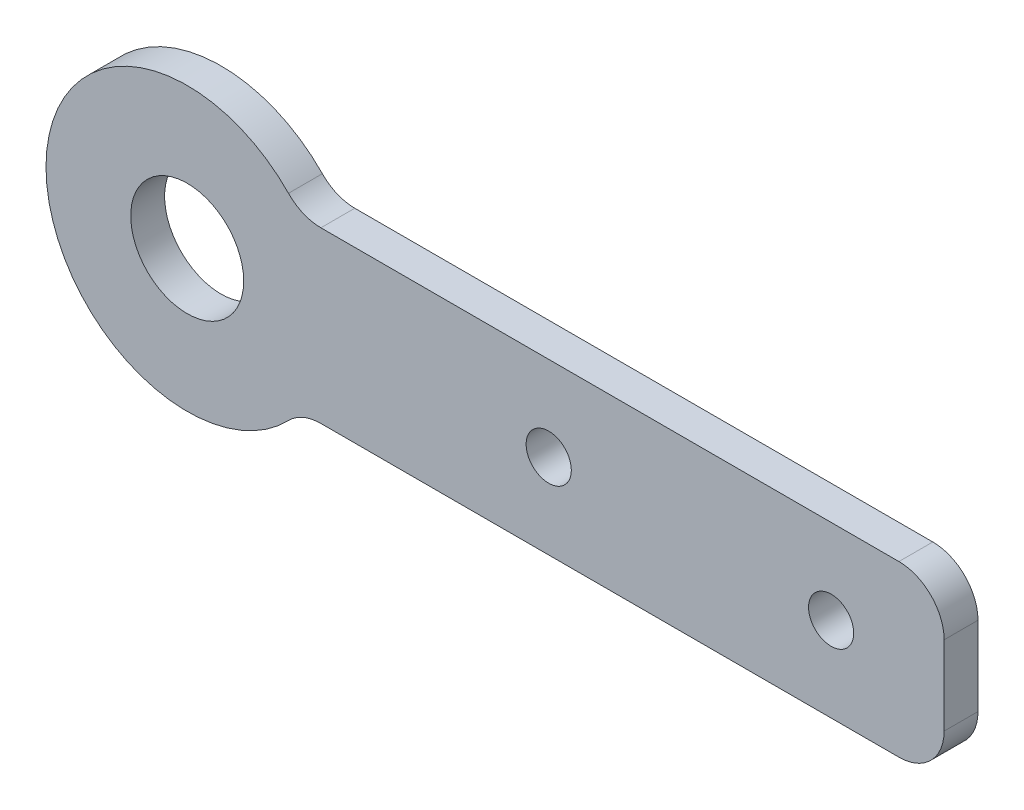
ISO-10303-21;
HEADER;
FILE_DESCRIPTION(('STEP AP214'),'2;1');
FILE_NAME('part.step','',(''),(''),'','','');
FILE_SCHEMA(('AUTOMOTIVE_DESIGN { 1 0 10303 214 1 1 1 1 }'));
ENDSEC;
DATA;
#1=APPLICATION_CONTEXT('core data for automotive mechanical design processes');
#2=APPLICATION_PROTOCOL_DEFINITION('international standard','automotive_design',2000,#1);
#3=PRODUCT_CONTEXT('',#1,'mechanical');
#4=PRODUCT('Part','Part','',(#3));
#5=PRODUCT_RELATED_PRODUCT_CATEGORY('part','',(#4));
#6=PRODUCT_DEFINITION_FORMATION('','',#4);
#7=PRODUCT_DEFINITION_CONTEXT('part definition',#1,'design');
#8=PRODUCT_DEFINITION('design','',#6,#7);
#9=PRODUCT_DEFINITION_SHAPE('','',#8);
#10=(LENGTH_UNIT() NAMED_UNIT(*) SI_UNIT(.MILLI.,.METRE.));
#11=(NAMED_UNIT(*) PLANE_ANGLE_UNIT() SI_UNIT($,.RADIAN.));
#12=(NAMED_UNIT(*) SI_UNIT($,.STERADIAN.) SOLID_ANGLE_UNIT());
#13=UNCERTAINTY_MEASURE_WITH_UNIT(LENGTH_MEASURE(1.E-05),#10,'distance_accuracy_value','');
#14=(GEOMETRIC_REPRESENTATION_CONTEXT(3) GLOBAL_UNCERTAINTY_ASSIGNED_CONTEXT((#13)) GLOBAL_UNIT_ASSIGNED_CONTEXT((#10,
#11,#12)) REPRESENTATION_CONTEXT('',''));
#15=CARTESIAN_POINT('',(0.,0.,0.));
#16=DIRECTION('',(0.,0.,1.));
#17=DIRECTION('',(1.,0.,0.));
#18=AXIS2_PLACEMENT_3D('',#15,#16,#17);
#19=CARTESIAN_POINT('',(10.,7.5,3.));
#20=DIRECTION('',(0.,0.,-1.));
#21=DIRECTION('',(-1.,0.,0.));
#22=AXIS2_PLACEMENT_3D('',#19,#20,#21);
#23=CYLINDRICAL_SURFACE('',#22,12.5);
#24=CARTESIAN_POINT('',(10.,7.5,3.));
#25=DIRECTION('',(0.,0.,1.));
#26=DIRECTION('',(1.,0.,0.));
#27=AXIS2_PLACEMENT_3D('',#24,#25,#26);
#28=CIRCLE('',#27,12.5);
#29=CARTESIAN_POINT('',(18.9637572471206,16.2121212121212,3.));
#30=VERTEX_POINT('',#29);
#31=CARTESIAN_POINT('',(18.9637572471206,-1.21212121212121,3.));
#32=VERTEX_POINT('',#31);
#33=EDGE_CURVE('E132',#30,#32,#28,.T.);
#34=ORIENTED_EDGE('',*,*,#33,.F.);
#35=DIRECTION('',(0.,0.,-1.));
#36=VECTOR('',#35,1.);
#37=CARTESIAN_POINT('',(18.9637572471206,16.2121212121212,3.));
#38=LINE('',#37,#36);
#39=CARTESIAN_POINT('',(18.9637572471206,16.2121212121212,0.));
#40=VERTEX_POINT('',#39);
#41=EDGE_CURVE('E117',#30,#40,#38,.T.);
#42=ORIENTED_EDGE('',*,*,#41,.T.);
#43=CARTESIAN_POINT('',(10.,7.5,0.));
#44=DIRECTION('',(0.,0.,1.));
#45=DIRECTION('',(1.,0.,0.));
#46=AXIS2_PLACEMENT_3D('',#43,#44,#45);
#47=CIRCLE('',#46,12.5);
#48=CARTESIAN_POINT('',(18.9637572471206,-1.21212121212121,0.));
#49=VERTEX_POINT('',#48);
#50=EDGE_CURVE('E130',#40,#49,#47,.T.);
#51=ORIENTED_EDGE('',*,*,#50,.T.);
#52=DIRECTION('',(0.,0.,-1.));
#53=VECTOR('',#52,1.);
#54=CARTESIAN_POINT('',(18.9637572471206,-1.21212121212121,3.));
#55=LINE('',#54,#53);
#56=EDGE_CURVE('E135',#49,#32,#55,.F.);
#57=ORIENTED_EDGE('',*,*,#56,.T.);
#58=EDGE_LOOP('',(#34,#42,#51,#57));
#59=FACE_BOUND('',#58,.T.);
#60=ADVANCED_FACE('F47',(#59),#23,.T.);
#61=CARTESIAN_POINT('',(0.,0.,3.));
#62=DIRECTION('',(0.,1.,0.));
#63=DIRECTION('',(0.,0.,1.));
#64=AXIS2_PLACEMENT_3D('',#61,#62,#63);
#65=PLANE('',#64);
#66=DIRECTION('',(1.,0.,0.));
#67=VECTOR('',#66,1.);
#68=CARTESIAN_POINT('',(0.,0.,0.));
#69=LINE('',#68,#67);
#70=CARTESIAN_POINT('',(21.8321595661992,0.,0.));
#71=VERTEX_POINT('',#70);
#72=CARTESIAN_POINT('',(73.,0.,0.));
#73=VERTEX_POINT('',#72);
#74=EDGE_CURVE('E141',#71,#73,#69,.T.);
#75=ORIENTED_EDGE('',*,*,#74,.T.);
#76=DIRECTION('',(0.,0.,-1.));
#77=VECTOR('',#76,1.);
#78=CARTESIAN_POINT('',(73.,0.,3.));
#79=LINE('',#78,#77);
#80=CARTESIAN_POINT('',(73.,0.,3.));
#81=VERTEX_POINT('',#80);
#82=EDGE_CURVE('E63',#73,#81,#79,.F.);
#83=ORIENTED_EDGE('',*,*,#82,.T.);
#84=DIRECTION('',(1.,0.,0.));
#85=VECTOR('',#84,1.);
#86=CARTESIAN_POINT('',(0.,0.,3.));
#87=LINE('',#86,#85);
#88=CARTESIAN_POINT('',(21.8321595661992,0.,3.));
#89=VERTEX_POINT('',#88);
#90=EDGE_CURVE('E201',#89,#81,#87,.T.);
#91=ORIENTED_EDGE('',*,*,#90,.F.);
#92=DIRECTION('',(0.,0.,1.));
#93=VECTOR('',#92,1.);
#94=CARTESIAN_POINT('',(21.8321595661992,0.,0.));
#95=LINE('',#94,#93);
#96=EDGE_CURVE('E181',#89,#71,#95,.F.);
#97=ORIENTED_EDGE('',*,*,#96,.T.);
#98=EDGE_LOOP('',(#75,#83,#91,#97));
#99=FACE_BOUND('',#98,.T.);
#100=ADVANCED_FACE('F245',(#99),#65,.F.);
#101=CARTESIAN_POINT('',(77.,0.,3.));
#102=DIRECTION('',(-1.,0.,0.));
#103=DIRECTION('',(0.,0.,1.));
#104=AXIS2_PLACEMENT_3D('',#101,#102,#103);
#105=PLANE('',#104);
#106=DIRECTION('',(0.,1.,0.));
#107=VECTOR('',#106,1.);
#108=CARTESIAN_POINT('',(77.,0.,3.));
#109=LINE('',#108,#107);
#110=CARTESIAN_POINT('',(77.,4.,3.));
#111=VERTEX_POINT('',#110);
#112=CARTESIAN_POINT('',(77.,11.,3.));
#113=VERTEX_POINT('',#112);
#114=EDGE_CURVE('E197',#111,#113,#109,.T.);
#115=ORIENTED_EDGE('',*,*,#114,.F.);
#116=DIRECTION('',(0.,0.,-1.));
#117=VECTOR('',#116,1.);
#118=CARTESIAN_POINT('',(77.,4.,3.));
#119=LINE('',#118,#117);
#120=CARTESIAN_POINT('',(77.,4.,0.));
#121=VERTEX_POINT('',#120);
#122=EDGE_CURVE('E171',#111,#121,#119,.T.);
#123=ORIENTED_EDGE('',*,*,#122,.T.);
#124=DIRECTION('',(0.,1.,0.));
#125=VECTOR('',#124,1.);
#126=CARTESIAN_POINT('',(77.,0.,0.));
#127=LINE('',#126,#125);
#128=CARTESIAN_POINT('',(77.,11.,0.));
#129=VERTEX_POINT('',#128);
#130=EDGE_CURVE('E146',#121,#129,#127,.T.);
#131=ORIENTED_EDGE('',*,*,#130,.T.);
#132=DIRECTION('',(0.,0.,-1.));
#133=VECTOR('',#132,1.);
#134=CARTESIAN_POINT('',(77.,11.,3.));
#135=LINE('',#134,#133);
#136=EDGE_CURVE('E168',#129,#113,#135,.F.);
#137=ORIENTED_EDGE('',*,*,#136,.T.);
#138=EDGE_LOOP('',(#115,#123,#131,#137));
#139=FACE_BOUND('',#138,.T.);
#140=ADVANCED_FACE('F241',(#139),#105,.F.);
#141=CARTESIAN_POINT('',(10.,7.5,3.));
#142=DIRECTION('',(0.,0.,-1.));
#143=DIRECTION('',(-1.,0.,0.));
#144=AXIS2_PLACEMENT_3D('',#141,#142,#143);
#145=CYLINDRICAL_SURFACE('',#144,5.);
#146=CARTESIAN_POINT('',(10.,7.5,3.));
#147=DIRECTION('',(0.,0.,1.));
#148=DIRECTION('',(1.,0.,0.));
#149=AXIS2_PLACEMENT_3D('',#146,#147,#148);
#150=CIRCLE('',#149,5.);
#151=CARTESIAN_POINT('',(15.,7.5,3.));
#152=VERTEX_POINT('',#151);
#153=EDGE_CURVE('E206',#152,#152,#150,.T.);
#154=ORIENTED_EDGE('',*,*,#153,.T.);
#155=EDGE_LOOP('',(#154));
#156=FACE_BOUND('',#155,.T.);
#157=CARTESIAN_POINT('',(10.,7.5,0.));
#158=DIRECTION('',(0.,0.,1.));
#159=DIRECTION('',(1.,0.,0.));
#160=AXIS2_PLACEMENT_3D('',#157,#158,#159);
#161=CIRCLE('',#160,5.);
#162=CARTESIAN_POINT('',(15.,7.5,0.));
#163=VERTEX_POINT('',#162);
#164=EDGE_CURVE('E142',#163,#163,#161,.T.);
#165=ORIENTED_EDGE('',*,*,#164,.F.);
#166=EDGE_LOOP('',(#165));
#167=FACE_BOUND('',#166,.T.);
#168=ADVANCED_FACE('F232',(#156,#167),#145,.F.);
#169=CARTESIAN_POINT('',(67.,7.5,3.));
#170=DIRECTION('',(0.,0.,-1.));
#171=DIRECTION('',(-1.,0.,0.));
#172=AXIS2_PLACEMENT_3D('',#169,#170,#171);
#173=CYLINDRICAL_SURFACE('',#172,2.);
#174=CARTESIAN_POINT('',(67.,7.5,3.));
#175=DIRECTION('',(0.,0.,1.));
#176=DIRECTION('',(1.,0.,0.));
#177=AXIS2_PLACEMENT_3D('',#174,#175,#176);
#178=CIRCLE('',#177,2.);
#179=CARTESIAN_POINT('',(69.,7.5,3.));
#180=VERTEX_POINT('',#179);
#181=EDGE_CURVE('E210',#180,#180,#178,.T.);
#182=ORIENTED_EDGE('',*,*,#181,.T.);
#183=EDGE_LOOP('',(#182));
#184=FACE_BOUND('',#183,.T.);
#185=CARTESIAN_POINT('',(67.,7.5,0.));
#186=DIRECTION('',(0.,0.,1.));
#187=DIRECTION('',(1.,0.,0.));
#188=AXIS2_PLACEMENT_3D('',#185,#186,#187);
#189=CIRCLE('',#188,2.);
#190=CARTESIAN_POINT('',(69.,7.5,0.));
#191=VERTEX_POINT('',#190);
#192=EDGE_CURVE('E149',#191,#191,#189,.T.);
#193=ORIENTED_EDGE('',*,*,#192,.F.);
#194=EDGE_LOOP('',(#193));
#195=FACE_BOUND('',#194,.T.);
#196=ADVANCED_FACE('F229',(#184,#195),#173,.F.);
#197=CARTESIAN_POINT('',(42.,7.5,3.));
#198=DIRECTION('',(0.,0.,-1.));
#199=DIRECTION('',(-1.,0.,0.));
#200=AXIS2_PLACEMENT_3D('',#197,#198,#199);
#201=CYLINDRICAL_SURFACE('',#200,2.);
#202=CARTESIAN_POINT('',(42.,7.5,3.));
#203=DIRECTION('',(0.,0.,1.));
#204=DIRECTION('',(1.,0.,0.));
#205=AXIS2_PLACEMENT_3D('',#202,#203,#204);
#206=CIRCLE('',#205,2.);
#207=CARTESIAN_POINT('',(44.,7.5,3.));
#208=VERTEX_POINT('',#207);
#209=EDGE_CURVE('E159',#208,#208,#206,.T.);
#210=ORIENTED_EDGE('',*,*,#209,.T.);
#211=EDGE_LOOP('',(#210));
#212=FACE_BOUND('',#211,.T.);
#213=CARTESIAN_POINT('',(42.,7.5,0.));
#214=DIRECTION('',(0.,0.,1.));
#215=DIRECTION('',(1.,0.,0.));
#216=AXIS2_PLACEMENT_3D('',#213,#214,#215);
#217=CIRCLE('',#216,2.);
#218=CARTESIAN_POINT('',(44.,7.5,0.));
#219=VERTEX_POINT('',#218);
#220=EDGE_CURVE('E220',#219,#219,#217,.T.);
#221=ORIENTED_EDGE('',*,*,#220,.F.);
#222=EDGE_LOOP('',(#221));
#223=FACE_BOUND('',#222,.T.);
#224=ADVANCED_FACE('F231',(#212,#223),#201,.F.);
#225=CARTESIAN_POINT('',(0.,15.,3.));
#226=DIRECTION('',(0.,1.,0.));
#227=DIRECTION('',(0.,0.,1.));
#228=AXIS2_PLACEMENT_3D('',#225,#226,#227);
#229=PLANE('',#228);
#230=DIRECTION('',(1.,0.,0.));
#231=VECTOR('',#230,1.);
#232=CARTESIAN_POINT('',(0.,15.,0.));
#233=LINE('',#232,#231);
#234=CARTESIAN_POINT('',(21.8321595661992,15.,0.));
#235=VERTEX_POINT('',#234);
#236=CARTESIAN_POINT('',(73.,15.,0.));
#237=VERTEX_POINT('',#236);
#238=EDGE_CURVE('E156',#235,#237,#233,.T.);
#239=ORIENTED_EDGE('',*,*,#238,.F.);
#240=DIRECTION('',(0.,0.,-1.));
#241=VECTOR('',#240,1.);
#242=CARTESIAN_POINT('',(21.8321595661992,15.,3.));
#243=LINE('',#242,#241);
#244=CARTESIAN_POINT('',(21.8321595661992,15.,3.));
#245=VERTEX_POINT('',#244);
#246=EDGE_CURVE('E118',#235,#245,#243,.F.);
#247=ORIENTED_EDGE('',*,*,#246,.T.);
#248=DIRECTION('',(1.,0.,0.));
#249=VECTOR('',#248,1.);
#250=CARTESIAN_POINT('',(0.,15.,3.));
#251=LINE('',#250,#249);
#252=CARTESIAN_POINT('',(73.,15.,3.));
#253=VERTEX_POINT('',#252);
#254=EDGE_CURVE('E161',#245,#253,#251,.T.);
#255=ORIENTED_EDGE('',*,*,#254,.T.);
#256=DIRECTION('',(0.,0.,-1.));
#257=VECTOR('',#256,1.);
#258=CARTESIAN_POINT('',(73.,15.,0.));
#259=LINE('',#258,#257);
#260=EDGE_CURVE('E134',#253,#237,#259,.T.);
#261=ORIENTED_EDGE('',*,*,#260,.T.);
#262=EDGE_LOOP('',(#239,#247,#255,#261));
#263=FACE_BOUND('',#262,.T.);
#264=ADVANCED_FACE('F239',(#263),#229,.T.);
#265=CARTESIAN_POINT('',(0.,0.,3.));
#266=DIRECTION('',(0.,0.,1.));
#267=DIRECTION('',(1.,0.,0.));
#268=AXIS2_PLACEMENT_3D('',#265,#266,#267);
#269=PLANE('',#268);
#270=ORIENTED_EDGE('',*,*,#209,.F.);
#271=EDGE_LOOP('',(#270));
#272=FACE_BOUND('',#271,.T.);
#273=ORIENTED_EDGE('',*,*,#181,.F.);
#274=EDGE_LOOP('',(#273));
#275=FACE_BOUND('',#274,.T.);
#276=ORIENTED_EDGE('',*,*,#153,.F.);
#277=EDGE_LOOP('',(#276));
#278=FACE_BOUND('',#277,.T.);
#279=ORIENTED_EDGE('',*,*,#90,.T.);
#280=CARTESIAN_POINT('',(73.,4.,3.));
#281=DIRECTION('',(0.,0.,1.));
#282=DIRECTION('',(1.,0.,0.));
#283=AXIS2_PLACEMENT_3D('',#280,#281,#282);
#284=CIRCLE('',#283,4.);
#285=EDGE_CURVE('E125',#81,#111,#284,.T.);
#286=ORIENTED_EDGE('',*,*,#285,.T.);
#287=ORIENTED_EDGE('',*,*,#114,.T.);
#288=CARTESIAN_POINT('',(73.,11.,3.));
#289=DIRECTION('',(0.,0.,1.));
#290=DIRECTION('',(1.,0.,0.));
#291=AXIS2_PLACEMENT_3D('',#288,#289,#290);
#292=CIRCLE('',#291,4.);
#293=EDGE_CURVE('E187',#113,#253,#292,.T.);
#294=ORIENTED_EDGE('',*,*,#293,.T.);
#295=ORIENTED_EDGE('',*,*,#254,.F.);
#296=CARTESIAN_POINT('',(21.8321595661992,19.,3.));
#297=DIRECTION('',(0.,0.,1.));
#298=DIRECTION('',(1.,0.,0.));
#299=AXIS2_PLACEMENT_3D('',#296,#297,#298);
#300=CIRCLE('',#299,4.);
#301=EDGE_CURVE('E124',#245,#30,#300,.F.);
#302=ORIENTED_EDGE('',*,*,#301,.T.);
#303=ORIENTED_EDGE('',*,*,#33,.T.);
#304=CARTESIAN_POINT('',(21.8321595661992,-4.,3.));
#305=DIRECTION('',(0.,0.,1.));
#306=DIRECTION('',(1.,0.,0.));
#307=AXIS2_PLACEMENT_3D('',#304,#305,#306);
#308=CIRCLE('',#307,4.);
#309=EDGE_CURVE('E11',#32,#89,#308,.F.);
#310=ORIENTED_EDGE('',*,*,#309,.T.);
#311=EDGE_LOOP('',(#279,#286,#287,#294,#295,#302,#303,#310));
#312=FACE_BOUND('',#311,.T.);
#313=ADVANCED_FACE('F257',(#272,#275,#278,#312),#269,.T.);
#314=CARTESIAN_POINT('',(0.,0.,0.));
#315=DIRECTION('',(0.,0.,1.));
#316=DIRECTION('',(1.,0.,0.));
#317=AXIS2_PLACEMENT_3D('',#314,#315,#316);
#318=PLANE('',#317);
#319=ORIENTED_EDGE('',*,*,#220,.T.);
#320=EDGE_LOOP('',(#319));
#321=FACE_BOUND('',#320,.T.);
#322=ORIENTED_EDGE('',*,*,#192,.T.);
#323=EDGE_LOOP('',(#322));
#324=FACE_BOUND('',#323,.T.);
#325=ORIENTED_EDGE('',*,*,#164,.T.);
#326=EDGE_LOOP('',(#325));
#327=FACE_BOUND('',#326,.T.);
#328=ORIENTED_EDGE('',*,*,#130,.F.);
#329=CARTESIAN_POINT('',(73.,4.,0.));
#330=DIRECTION('',(0.,0.,1.));
#331=DIRECTION('',(1.,0.,0.));
#332=AXIS2_PLACEMENT_3D('',#329,#330,#331);
#333=CIRCLE('',#332,4.);
#334=EDGE_CURVE('E178',#121,#73,#333,.F.);
#335=ORIENTED_EDGE('',*,*,#334,.T.);
#336=ORIENTED_EDGE('',*,*,#74,.F.);
#337=CARTESIAN_POINT('',(21.8321595661992,-4.,0.));
#338=DIRECTION('',(0.,0.,1.));
#339=DIRECTION('',(1.,0.,0.));
#340=AXIS2_PLACEMENT_3D('',#337,#338,#339);
#341=CIRCLE('',#340,4.);
#342=EDGE_CURVE('E56',#71,#49,#341,.T.);
#343=ORIENTED_EDGE('',*,*,#342,.T.);
#344=ORIENTED_EDGE('',*,*,#50,.F.);
#345=CARTESIAN_POINT('',(21.8321595661992,19.,0.));
#346=DIRECTION('',(0.,0.,1.));
#347=DIRECTION('',(1.,0.,0.));
#348=AXIS2_PLACEMENT_3D('',#345,#346,#347);
#349=CIRCLE('',#348,4.);
#350=EDGE_CURVE('E113',#40,#235,#349,.T.);
#351=ORIENTED_EDGE('',*,*,#350,.T.);
#352=ORIENTED_EDGE('',*,*,#238,.T.);
#353=CARTESIAN_POINT('',(73.,11.,0.));
#354=DIRECTION('',(0.,0.,1.));
#355=DIRECTION('',(1.,0.,0.));
#356=AXIS2_PLACEMENT_3D('',#353,#354,#355);
#357=CIRCLE('',#356,4.);
#358=EDGE_CURVE('E175',#237,#129,#357,.F.);
#359=ORIENTED_EDGE('',*,*,#358,.T.);
#360=EDGE_LOOP('',(#328,#335,#336,#343,#344,#351,#352,#359));
#361=FACE_BOUND('',#360,.T.);
#362=ADVANCED_FACE('F138',(#321,#324,#327,#361),#318,.F.);
#363=CARTESIAN_POINT('',(21.8321595661992,19.,3.));
#364=DIRECTION('',(0.,0.,-1.));
#365=DIRECTION('',(-1.,0.,0.));
#366=AXIS2_PLACEMENT_3D('',#363,#364,#365);
#367=CYLINDRICAL_SURFACE('',#366,4.);
#368=ORIENTED_EDGE('',*,*,#301,.F.);
#369=ORIENTED_EDGE('',*,*,#246,.F.);
#370=ORIENTED_EDGE('',*,*,#350,.F.);
#371=ORIENTED_EDGE('',*,*,#41,.F.);
#372=EDGE_LOOP('',(#368,#369,#370,#371));
#373=FACE_BOUND('',#372,.T.);
#374=ADVANCED_FACE('F116',(#373),#367,.F.);
#375=CARTESIAN_POINT('',(73.,4.,3.));
#376=DIRECTION('',(0.,0.,-1.));
#377=DIRECTION('',(-1.,0.,0.));
#378=AXIS2_PLACEMENT_3D('',#375,#376,#377);
#379=CYLINDRICAL_SURFACE('',#378,4.);
#380=ORIENTED_EDGE('',*,*,#285,.F.);
#381=ORIENTED_EDGE('',*,*,#82,.F.);
#382=ORIENTED_EDGE('',*,*,#334,.F.);
#383=ORIENTED_EDGE('',*,*,#122,.F.);
#384=EDGE_LOOP('',(#380,#381,#382,#383));
#385=FACE_BOUND('',#384,.T.);
#386=ADVANCED_FACE('F275',(#385),#379,.T.);
#387=CARTESIAN_POINT('',(21.8321595661992,-4.,3.));
#388=DIRECTION('',(0.,0.,-1.));
#389=DIRECTION('',(-1.,0.,0.));
#390=AXIS2_PLACEMENT_3D('',#387,#388,#389);
#391=CYLINDRICAL_SURFACE('',#390,4.);
#392=ORIENTED_EDGE('',*,*,#309,.F.);
#393=ORIENTED_EDGE('',*,*,#56,.F.);
#394=ORIENTED_EDGE('',*,*,#342,.F.);
#395=ORIENTED_EDGE('',*,*,#96,.F.);
#396=EDGE_LOOP('',(#392,#393,#394,#395));
#397=FACE_BOUND('',#396,.T.);
#398=ADVANCED_FACE('F282',(#397),#391,.F.);
#399=CARTESIAN_POINT('',(73.,11.,3.));
#400=DIRECTION('',(0.,0.,1.));
#401=DIRECTION('',(1.,0.,0.));
#402=AXIS2_PLACEMENT_3D('',#399,#400,#401);
#403=CYLINDRICAL_SURFACE('',#402,4.);
#404=ORIENTED_EDGE('',*,*,#293,.F.);
#405=ORIENTED_EDGE('',*,*,#136,.F.);
#406=ORIENTED_EDGE('',*,*,#358,.F.);
#407=ORIENTED_EDGE('',*,*,#260,.F.);
#408=EDGE_LOOP('',(#404,#405,#406,#407));
#409=FACE_BOUND('',#408,.T.);
#410=ADVANCED_FACE('F49',(#409),#403,.T.);
#411=CLOSED_SHELL('',(#60,#100,#140,#168,#196,#224,#264,#313,#362,#374,#386,#398,#410));
#412=MANIFOLD_SOLID_BREP('B2',#411);
#413=ADVANCED_BREP_SHAPE_REPRESENTATION('',(#18,#412),#14);
#414=SHAPE_DEFINITION_REPRESENTATION(#9,#413);
ENDSEC;
END-ISO-10303-21;
